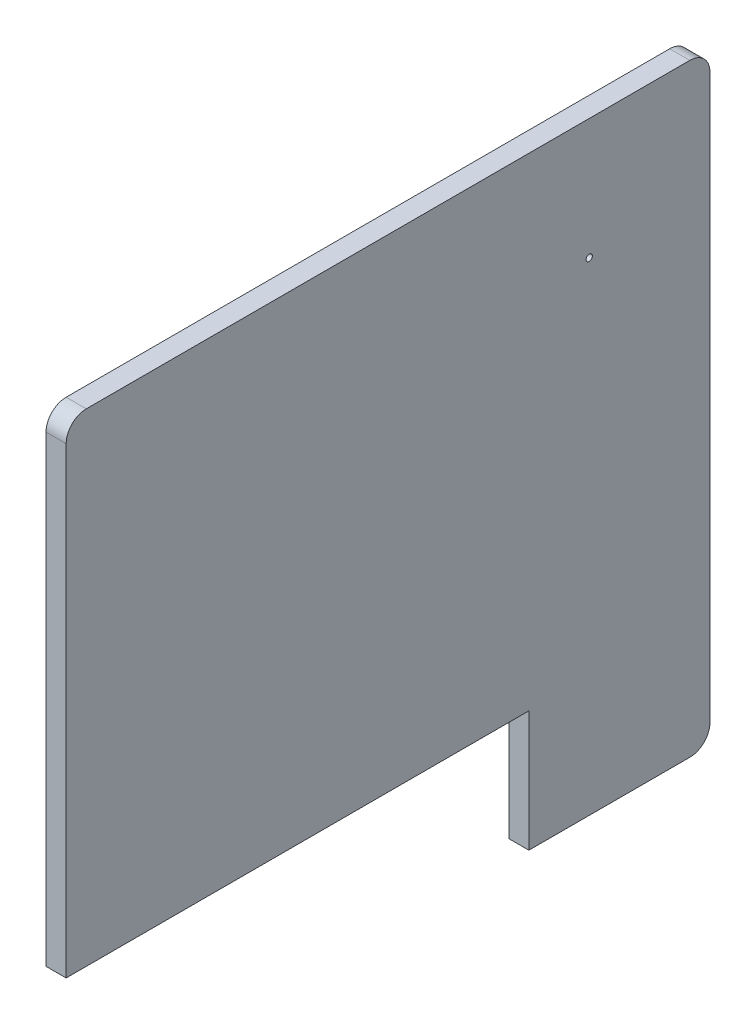
ISO-10303-21;
HEADER;
FILE_DESCRIPTION(('STEP AP214'),'2;1');
FILE_NAME('part.step','',(''),(''),'','','');
FILE_SCHEMA(('AUTOMOTIVE_DESIGN { 1 0 10303 214 1 1 1 1 }'));
ENDSEC;
DATA;
#1=APPLICATION_CONTEXT('core data for automotive mechanical design processes');
#2=APPLICATION_PROTOCOL_DEFINITION('international standard','automotive_design',2000,#1);
#3=PRODUCT_CONTEXT('',#1,'mechanical');
#4=PRODUCT('Part','Part','',(#3));
#5=PRODUCT_RELATED_PRODUCT_CATEGORY('part','',(#4));
#6=PRODUCT_DEFINITION_FORMATION('','',#4);
#7=PRODUCT_DEFINITION_CONTEXT('part definition',#1,'design');
#8=PRODUCT_DEFINITION('design','',#6,#7);
#9=PRODUCT_DEFINITION_SHAPE('','',#8);
#10=(LENGTH_UNIT() NAMED_UNIT(*) SI_UNIT(.MILLI.,.METRE.));
#11=(NAMED_UNIT(*) PLANE_ANGLE_UNIT() SI_UNIT($,.RADIAN.));
#12=(NAMED_UNIT(*) SI_UNIT($,.STERADIAN.) SOLID_ANGLE_UNIT());
#13=UNCERTAINTY_MEASURE_WITH_UNIT(LENGTH_MEASURE(1.E-05),#10,'distance_accuracy_value','');
#14=(GEOMETRIC_REPRESENTATION_CONTEXT(3) GLOBAL_UNCERTAINTY_ASSIGNED_CONTEXT((#13)) GLOBAL_UNIT_ASSIGNED_CONTEXT((#10,
#11,#12)) REPRESENTATION_CONTEXT('',''));
#15=CARTESIAN_POINT('',(0.,0.,0.));
#16=DIRECTION('',(0.,0.,1.));
#17=DIRECTION('',(1.,0.,0.));
#18=AXIS2_PLACEMENT_3D('',#15,#16,#17);
#19=CARTESIAN_POINT('',(3.175,0.,0.));
#20=DIRECTION('',(-1.,0.,0.));
#21=DIRECTION('',(0.,0.,1.));
#22=AXIS2_PLACEMENT_3D('',#19,#20,#21);
#23=PLANE('',#22);
#24=DIRECTION('',(0.,0.,-1.));
#25=VECTOR('',#24,1.);
#26=CARTESIAN_POINT('',(3.175,0.,0.));
#27=LINE('',#26,#25);
#28=CARTESIAN_POINT('',(3.175,0.,-73.025));
#29=VERTEX_POINT('',#28);
#30=CARTESIAN_POINT('',(3.175,0.,-98.425));
#31=VERTEX_POINT('',#30);
#32=EDGE_CURVE('E149',#29,#31,#27,.T.);
#33=ORIENTED_EDGE('',*,*,#32,.T.);
#34=CARTESIAN_POINT('',(3.175,3.175,-98.425));
#35=DIRECTION('',(-1.,0.,0.));
#36=DIRECTION('',(0.,0.,1.));
#37=AXIS2_PLACEMENT_3D('',#34,#35,#36);
#38=CIRCLE('',#37,3.175);
#39=CARTESIAN_POINT('',(3.175,3.175,-101.6));
#40=VERTEX_POINT('',#39);
#41=EDGE_CURVE('E179',#31,#40,#38,.F.);
#42=ORIENTED_EDGE('',*,*,#41,.T.);
#43=DIRECTION('',(0.,1.,0.));
#44=VECTOR('',#43,1.);
#45=CARTESIAN_POINT('',(3.175,0.,-101.6));
#46=LINE('',#45,#44);
#47=CARTESIAN_POINT('',(3.175,92.075,-101.6));
#48=VERTEX_POINT('',#47);
#49=EDGE_CURVE('E153',#40,#48,#46,.T.);
#50=ORIENTED_EDGE('',*,*,#49,.T.);
#51=CARTESIAN_POINT('',(3.175,92.075,-98.425));
#52=DIRECTION('',(-1.,0.,0.));
#53=DIRECTION('',(0.,0.,1.));
#54=AXIS2_PLACEMENT_3D('',#51,#52,#53);
#55=CIRCLE('',#54,3.175);
#56=CARTESIAN_POINT('',(3.175,95.25,-98.425));
#57=VERTEX_POINT('',#56);
#58=EDGE_CURVE('E55',#48,#57,#55,.F.);
#59=ORIENTED_EDGE('',*,*,#58,.T.);
#60=DIRECTION('',(0.,0.,1.));
#61=VECTOR('',#60,1.);
#62=CARTESIAN_POINT('',(3.175,95.25,0.));
#63=LINE('',#62,#61);
#64=CARTESIAN_POINT('',(3.175,95.25,-3.175));
#65=VERTEX_POINT('',#64);
#66=EDGE_CURVE('E155',#57,#65,#63,.T.);
#67=ORIENTED_EDGE('',*,*,#66,.T.);
#68=CARTESIAN_POINT('',(3.175,92.075,-3.175));
#69=DIRECTION('',(-1.,0.,0.));
#70=DIRECTION('',(0.,0.,1.));
#71=AXIS2_PLACEMENT_3D('',#68,#69,#70);
#72=CIRCLE('',#71,3.175);
#73=CARTESIAN_POINT('',(3.175,92.075,0.));
#74=VERTEX_POINT('',#73);
#75=EDGE_CURVE('E176',#65,#74,#72,.F.);
#76=ORIENTED_EDGE('',*,*,#75,.T.);
#77=DIRECTION('',(0.,-1.,0.));
#78=VECTOR('',#77,1.);
#79=CARTESIAN_POINT('',(3.175,0.,0.));
#80=LINE('',#79,#78);
#81=CARTESIAN_POINT('',(3.175,19.05,0.));
#82=VERTEX_POINT('',#81);
#83=EDGE_CURVE('E147',#74,#82,#80,.T.);
#84=ORIENTED_EDGE('',*,*,#83,.T.);
#85=DIRECTION('',(0.,0.,1.));
#86=VECTOR('',#85,1.);
#87=CARTESIAN_POINT('',(3.175,19.05,0.));
#88=LINE('',#87,#86);
#89=CARTESIAN_POINT('',(3.175,19.05,-73.025));
#90=VERTEX_POINT('',#89);
#91=EDGE_CURVE('E133',#90,#82,#88,.T.);
#92=ORIENTED_EDGE('',*,*,#91,.F.);
#93=DIRECTION('',(0.,1.,0.));
#94=VECTOR('',#93,1.);
#95=CARTESIAN_POINT('',(3.175,0.,-73.025));
#96=LINE('',#95,#94);
#97=EDGE_CURVE('E112',#29,#90,#96,.T.);
#98=ORIENTED_EDGE('',*,*,#97,.F.);
#99=EDGE_LOOP('',(#33,#42,#50,#59,#67,#76,#84,#92,#98));
#100=FACE_BOUND('',#99,.T.);
#101=CARTESIAN_POINT('',(3.175,76.2,-82.55));
#102=DIRECTION('',(1.,0.,0.));
#103=DIRECTION('',(0.,0.,-1.));
#104=AXIS2_PLACEMENT_3D('',#101,#102,#103);
#105=CIRCLE('',#104,0.499999999999999);
#106=CARTESIAN_POINT('',(3.175,76.2,-83.05));
#107=VERTEX_POINT('',#106);
#108=EDGE_CURVE('E141',#107,#107,#105,.T.);
#109=ORIENTED_EDGE('',*,*,#108,.F.);
#110=EDGE_LOOP('',(#109));
#111=FACE_BOUND('',#110,.T.);
#112=ADVANCED_FACE('F33',(#100,#111),#23,.F.);
#113=CARTESIAN_POINT('',(0.,0.,0.));
#114=DIRECTION('',(-1.,0.,0.));
#115=DIRECTION('',(0.,0.,1.));
#116=AXIS2_PLACEMENT_3D('',#113,#114,#115);
#117=PLANE('',#116);
#118=DIRECTION('',(0.,1.,0.));
#119=VECTOR('',#118,1.);
#120=CARTESIAN_POINT('',(0.,0.,-101.6));
#121=LINE('',#120,#119);
#122=CARTESIAN_POINT('',(0.,3.175,-101.6));
#123=VERTEX_POINT('',#122);
#124=CARTESIAN_POINT('',(0.,92.075,-101.6));
#125=VERTEX_POINT('',#124);
#126=EDGE_CURVE('E160',#123,#125,#121,.T.);
#127=ORIENTED_EDGE('',*,*,#126,.F.);
#128=CARTESIAN_POINT('',(0.,3.175,-98.425));
#129=DIRECTION('',(-1.,0.,0.));
#130=DIRECTION('',(0.,0.,1.));
#131=AXIS2_PLACEMENT_3D('',#128,#129,#130);
#132=CIRCLE('',#131,3.175);
#133=CARTESIAN_POINT('',(0.,0.,-98.425));
#134=VERTEX_POINT('',#133);
#135=EDGE_CURVE('E172',#123,#134,#132,.T.);
#136=ORIENTED_EDGE('',*,*,#135,.T.);
#137=DIRECTION('',(0.,0.,-1.));
#138=VECTOR('',#137,1.);
#139=CARTESIAN_POINT('',(0.,0.,0.));
#140=LINE('',#139,#138);
#141=CARTESIAN_POINT('',(0.,0.,-73.025));
#142=VERTEX_POINT('',#141);
#143=EDGE_CURVE('E132',#142,#134,#140,.T.);
#144=ORIENTED_EDGE('',*,*,#143,.F.);
#145=DIRECTION('',(0.,1.,0.));
#146=VECTOR('',#145,1.);
#147=CARTESIAN_POINT('',(0.,0.,-73.025));
#148=LINE('',#147,#146);
#149=CARTESIAN_POINT('',(0.,19.05,-73.025));
#150=VERTEX_POINT('',#149);
#151=EDGE_CURVE('E109',#142,#150,#148,.T.);
#152=ORIENTED_EDGE('',*,*,#151,.T.);
#153=DIRECTION('',(0.,0.,1.));
#154=VECTOR('',#153,1.);
#155=CARTESIAN_POINT('',(0.,19.05,0.));
#156=LINE('',#155,#154);
#157=CARTESIAN_POINT('',(0.,19.05,0.));
#158=VERTEX_POINT('',#157);
#159=EDGE_CURVE('E121',#150,#158,#156,.T.);
#160=ORIENTED_EDGE('',*,*,#159,.T.);
#161=DIRECTION('',(0.,-1.,0.));
#162=VECTOR('',#161,1.);
#163=CARTESIAN_POINT('',(0.,0.,0.));
#164=LINE('',#163,#162);
#165=CARTESIAN_POINT('',(0.,92.075,0.));
#166=VERTEX_POINT('',#165);
#167=EDGE_CURVE('E144',#166,#158,#164,.T.);
#168=ORIENTED_EDGE('',*,*,#167,.F.);
#169=CARTESIAN_POINT('',(0.,92.075,-3.175));
#170=DIRECTION('',(-1.,0.,0.));
#171=DIRECTION('',(0.,0.,1.));
#172=AXIS2_PLACEMENT_3D('',#169,#170,#171);
#173=CIRCLE('',#172,3.175);
#174=CARTESIAN_POINT('',(0.,95.25,-3.175));
#175=VERTEX_POINT('',#174);
#176=EDGE_CURVE('E168',#166,#175,#173,.T.);
#177=ORIENTED_EDGE('',*,*,#176,.T.);
#178=DIRECTION('',(0.,0.,1.));
#179=VECTOR('',#178,1.);
#180=CARTESIAN_POINT('',(0.,95.25,0.));
#181=LINE('',#180,#179);
#182=CARTESIAN_POINT('',(0.,95.25,-98.425));
#183=VERTEX_POINT('',#182);
#184=EDGE_CURVE('E150',#183,#175,#181,.T.);
#185=ORIENTED_EDGE('',*,*,#184,.F.);
#186=CARTESIAN_POINT('',(0.,92.075,-98.425));
#187=DIRECTION('',(-1.,0.,0.));
#188=DIRECTION('',(0.,0.,1.));
#189=AXIS2_PLACEMENT_3D('',#186,#187,#188);
#190=CIRCLE('',#189,3.175);
#191=EDGE_CURVE('E170',#183,#125,#190,.T.);
#192=ORIENTED_EDGE('',*,*,#191,.T.);
#193=EDGE_LOOP('',(#127,#136,#144,#152,#160,#168,#177,#185,#192));
#194=FACE_BOUND('',#193,.T.);
#195=CARTESIAN_POINT('',(0.,76.2,-82.55));
#196=DIRECTION('',(1.,0.,0.));
#197=DIRECTION('',(0.,0.,-1.));
#198=AXIS2_PLACEMENT_3D('',#195,#196,#197);
#199=CIRCLE('',#198,0.499999999999999);
#200=CARTESIAN_POINT('',(0.,76.2,-83.05));
#201=VERTEX_POINT('',#200);
#202=EDGE_CURVE('E138',#201,#201,#199,.T.);
#203=ORIENTED_EDGE('',*,*,#202,.T.);
#204=EDGE_LOOP('',(#203));
#205=FACE_BOUND('',#204,.T.);
#206=ADVANCED_FACE('F129',(#194,#205),#117,.T.);
#207=CARTESIAN_POINT('',(3.175,0.,0.));
#208=DIRECTION('',(0.,0.,-1.));
#209=DIRECTION('',(-1.,0.,0.));
#210=AXIS2_PLACEMENT_3D('',#207,#208,#209);
#211=PLANE('',#210);
#212=ORIENTED_EDGE('',*,*,#83,.F.);
#213=DIRECTION('',(-1.,0.,0.));
#214=VECTOR('',#213,1.);
#215=CARTESIAN_POINT('',(3.175,92.075,0.));
#216=LINE('',#215,#214);
#217=EDGE_CURVE('E11',#74,#166,#216,.T.);
#218=ORIENTED_EDGE('',*,*,#217,.T.);
#219=ORIENTED_EDGE('',*,*,#167,.T.);
#220=DIRECTION('',(1.,0.,0.));
#221=VECTOR('',#220,1.);
#222=CARTESIAN_POINT('',(0.,19.05,0.));
#223=LINE('',#222,#221);
#224=EDGE_CURVE('E116',#158,#82,#223,.T.);
#225=ORIENTED_EDGE('',*,*,#224,.T.);
#226=EDGE_LOOP('',(#212,#218,#219,#225));
#227=FACE_BOUND('',#226,.T.);
#228=ADVANCED_FACE('F191',(#227),#211,.F.);
#229=CARTESIAN_POINT('',(3.175,0.,0.));
#230=DIRECTION('',(0.,1.,0.));
#231=DIRECTION('',(0.,0.,1.));
#232=AXIS2_PLACEMENT_3D('',#229,#230,#231);
#233=PLANE('',#232);
#234=ORIENTED_EDGE('',*,*,#143,.T.);
#235=DIRECTION('',(-1.,0.,0.));
#236=VECTOR('',#235,1.);
#237=CARTESIAN_POINT('',(3.175,0.,-98.425));
#238=LINE('',#237,#236);
#239=EDGE_CURVE('E174',#134,#31,#238,.F.);
#240=ORIENTED_EDGE('',*,*,#239,.T.);
#241=ORIENTED_EDGE('',*,*,#32,.F.);
#242=DIRECTION('',(1.,0.,0.));
#243=VECTOR('',#242,1.);
#244=CARTESIAN_POINT('',(0.,0.,-73.025));
#245=LINE('',#244,#243);
#246=EDGE_CURVE('E117',#142,#29,#245,.T.);
#247=ORIENTED_EDGE('',*,*,#246,.F.);
#248=EDGE_LOOP('',(#234,#240,#241,#247));
#249=FACE_BOUND('',#248,.T.);
#250=ADVANCED_FACE('F196',(#249),#233,.F.);
#251=CARTESIAN_POINT('',(3.175,0.,-101.6));
#252=DIRECTION('',(0.,0.,1.));
#253=DIRECTION('',(1.,0.,0.));
#254=AXIS2_PLACEMENT_3D('',#251,#252,#253);
#255=PLANE('',#254);
#256=ORIENTED_EDGE('',*,*,#49,.F.);
#257=DIRECTION('',(-1.,0.,0.));
#258=VECTOR('',#257,1.);
#259=CARTESIAN_POINT('',(3.175,3.175,-101.6));
#260=LINE('',#259,#258);
#261=EDGE_CURVE('E165',#40,#123,#260,.T.);
#262=ORIENTED_EDGE('',*,*,#261,.T.);
#263=ORIENTED_EDGE('',*,*,#126,.T.);
#264=DIRECTION('',(-1.,0.,0.));
#265=VECTOR('',#264,1.);
#266=CARTESIAN_POINT('',(3.175,92.075,-101.6));
#267=LINE('',#266,#265);
#268=EDGE_CURVE('E157',#125,#48,#267,.F.);
#269=ORIENTED_EDGE('',*,*,#268,.T.);
#270=EDGE_LOOP('',(#256,#262,#263,#269));
#271=FACE_BOUND('',#270,.T.);
#272=ADVANCED_FACE('F203',(#271),#255,.F.);
#273=CARTESIAN_POINT('',(3.175,95.25,0.));
#274=DIRECTION('',(0.,-1.,0.));
#275=DIRECTION('',(0.,0.,-1.));
#276=AXIS2_PLACEMENT_3D('',#273,#274,#275);
#277=PLANE('',#276);
#278=ORIENTED_EDGE('',*,*,#66,.F.);
#279=DIRECTION('',(-1.,0.,0.));
#280=VECTOR('',#279,1.);
#281=CARTESIAN_POINT('',(3.175,95.25,-98.425));
#282=LINE('',#281,#280);
#283=EDGE_CURVE('E41',#57,#183,#282,.T.);
#284=ORIENTED_EDGE('',*,*,#283,.T.);
#285=ORIENTED_EDGE('',*,*,#184,.T.);
#286=DIRECTION('',(-1.,0.,0.));
#287=VECTOR('',#286,1.);
#288=CARTESIAN_POINT('',(3.175,95.25,-3.175));
#289=LINE('',#288,#287);
#290=EDGE_CURVE('E48',#175,#65,#289,.F.);
#291=ORIENTED_EDGE('',*,*,#290,.T.);
#292=EDGE_LOOP('',(#278,#284,#285,#291));
#293=FACE_BOUND('',#292,.T.);
#294=ADVANCED_FACE('F184',(#293),#277,.F.);
#295=CARTESIAN_POINT('',(3.175,76.2,-82.55));
#296=DIRECTION('',(-1.,0.,0.));
#297=DIRECTION('',(0.,0.,1.));
#298=AXIS2_PLACEMENT_3D('',#295,#296,#297);
#299=CYLINDRICAL_SURFACE('',#298,0.499999999999999);
#300=ORIENTED_EDGE('',*,*,#108,.T.);
#301=EDGE_LOOP('',(#300));
#302=FACE_BOUND('',#301,.T.);
#303=ORIENTED_EDGE('',*,*,#202,.F.);
#304=EDGE_LOOP('',(#303));
#305=FACE_BOUND('',#304,.T.);
#306=ADVANCED_FACE('F219',(#302,#305),#299,.F.);
#307=CARTESIAN_POINT('',(0.,19.05,0.));
#308=DIRECTION('',(0.,1.,0.));
#309=DIRECTION('',(0.,0.,1.));
#310=AXIS2_PLACEMENT_3D('',#307,#308,#309);
#311=PLANE('',#310);
#312=ORIENTED_EDGE('',*,*,#91,.T.);
#313=ORIENTED_EDGE('',*,*,#224,.F.);
#314=ORIENTED_EDGE('',*,*,#159,.F.);
#315=DIRECTION('',(1.,0.,0.));
#316=VECTOR('',#315,1.);
#317=CARTESIAN_POINT('',(0.,19.05,-73.025));
#318=LINE('',#317,#316);
#319=EDGE_CURVE('E105',#150,#90,#318,.T.);
#320=ORIENTED_EDGE('',*,*,#319,.T.);
#321=EDGE_LOOP('',(#312,#313,#314,#320));
#322=FACE_BOUND('',#321,.T.);
#323=ADVANCED_FACE('F122',(#322),#311,.F.);
#324=CARTESIAN_POINT('',(0.,0.,-73.025));
#325=DIRECTION('',(0.,0.,-1.));
#326=DIRECTION('',(0.,1.,0.));
#327=AXIS2_PLACEMENT_3D('',#324,#325,#326);
#328=PLANE('',#327);
#329=ORIENTED_EDGE('',*,*,#97,.T.);
#330=ORIENTED_EDGE('',*,*,#319,.F.);
#331=ORIENTED_EDGE('',*,*,#151,.F.);
#332=ORIENTED_EDGE('',*,*,#246,.T.);
#333=EDGE_LOOP('',(#329,#330,#331,#332));
#334=FACE_BOUND('',#333,.T.);
#335=ADVANCED_FACE('F107',(#334),#328,.F.);
#336=CARTESIAN_POINT('',(3.175,3.175,-98.425));
#337=DIRECTION('',(-1.,0.,0.));
#338=DIRECTION('',(0.,0.,1.));
#339=AXIS2_PLACEMENT_3D('',#336,#337,#338);
#340=CYLINDRICAL_SURFACE('',#339,3.175);
#341=ORIENTED_EDGE('',*,*,#41,.F.);
#342=ORIENTED_EDGE('',*,*,#239,.F.);
#343=ORIENTED_EDGE('',*,*,#135,.F.);
#344=ORIENTED_EDGE('',*,*,#261,.F.);
#345=EDGE_LOOP('',(#341,#342,#343,#344));
#346=FACE_BOUND('',#345,.T.);
#347=ADVANCED_FACE('F199',(#346),#340,.T.);
#348=CARTESIAN_POINT('',(3.175,92.075,-98.425));
#349=DIRECTION('',(-1.,0.,0.));
#350=DIRECTION('',(0.,0.,1.));
#351=AXIS2_PLACEMENT_3D('',#348,#349,#350);
#352=CYLINDRICAL_SURFACE('',#351,3.175);
#353=ORIENTED_EDGE('',*,*,#58,.F.);
#354=ORIENTED_EDGE('',*,*,#268,.F.);
#355=ORIENTED_EDGE('',*,*,#191,.F.);
#356=ORIENTED_EDGE('',*,*,#283,.F.);
#357=EDGE_LOOP('',(#353,#354,#355,#356));
#358=FACE_BOUND('',#357,.T.);
#359=ADVANCED_FACE('F205',(#358),#352,.T.);
#360=CARTESIAN_POINT('',(3.175,92.075,-3.175));
#361=DIRECTION('',(-1.,0.,0.));
#362=DIRECTION('',(0.,0.,1.));
#363=AXIS2_PLACEMENT_3D('',#360,#361,#362);
#364=CYLINDRICAL_SURFACE('',#363,3.175);
#365=ORIENTED_EDGE('',*,*,#75,.F.);
#366=ORIENTED_EDGE('',*,*,#290,.F.);
#367=ORIENTED_EDGE('',*,*,#176,.F.);
#368=ORIENTED_EDGE('',*,*,#217,.F.);
#369=EDGE_LOOP('',(#365,#366,#367,#368));
#370=FACE_BOUND('',#369,.T.);
#371=ADVANCED_FACE('F35',(#370),#364,.T.);
#372=CLOSED_SHELL('',(#112,#206,#228,#250,#272,#294,#306,#323,#335,#347,#359,#371));
#373=MANIFOLD_SOLID_BREP('B2',#372);
#374=ADVANCED_BREP_SHAPE_REPRESENTATION('',(#18,#373),#14);
#375=SHAPE_DEFINITION_REPRESENTATION(#9,#374);
ENDSEC;
END-ISO-10303-21;
